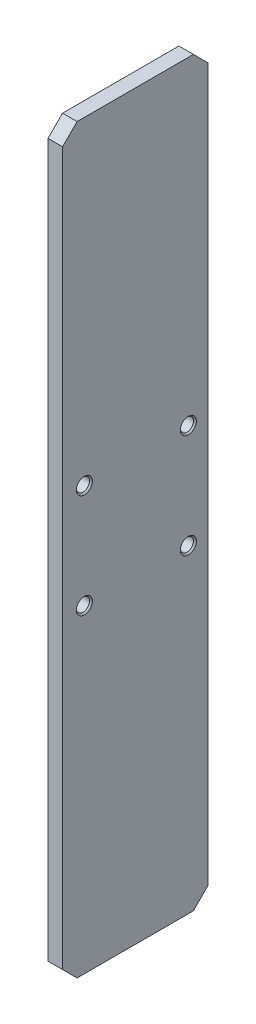
ISO-10303-21;
HEADER;
FILE_DESCRIPTION(('STEP AP214'),'2;1');
FILE_NAME('part.step','',(''),(''),'','','');
FILE_SCHEMA(('AUTOMOTIVE_DESIGN { 1 0 10303 214 1 1 1 1 }'));
ENDSEC;
DATA;
#1=APPLICATION_CONTEXT('core data for automotive mechanical design processes');
#2=APPLICATION_PROTOCOL_DEFINITION('international standard','automotive_design',2000,#1);
#3=PRODUCT_CONTEXT('',#1,'mechanical');
#4=PRODUCT('Part','Part','',(#3));
#5=PRODUCT_RELATED_PRODUCT_CATEGORY('part','',(#4));
#6=PRODUCT_DEFINITION_FORMATION('','',#4);
#7=PRODUCT_DEFINITION_CONTEXT('part definition',#1,'design');
#8=PRODUCT_DEFINITION('design','',#6,#7);
#9=PRODUCT_DEFINITION_SHAPE('','',#8);
#10=(LENGTH_UNIT() NAMED_UNIT(*) SI_UNIT(.MILLI.,.METRE.));
#11=(NAMED_UNIT(*) PLANE_ANGLE_UNIT() SI_UNIT($,.RADIAN.));
#12=(NAMED_UNIT(*) SI_UNIT($,.STERADIAN.) SOLID_ANGLE_UNIT());
#13=UNCERTAINTY_MEASURE_WITH_UNIT(LENGTH_MEASURE(1.E-05),#10,'distance_accuracy_value','');
#14=(GEOMETRIC_REPRESENTATION_CONTEXT(3) GLOBAL_UNCERTAINTY_ASSIGNED_CONTEXT((#13)) GLOBAL_UNIT_ASSIGNED_CONTEXT((#10,
#11,#12)) REPRESENTATION_CONTEXT('',''));
#15=CARTESIAN_POINT('',(0.,0.,0.));
#16=DIRECTION('',(0.,0.,1.));
#17=DIRECTION('',(1.,0.,0.));
#18=AXIS2_PLACEMENT_3D('',#15,#16,#17);
#19=CARTESIAN_POINT('',(1585.,510.,-100.));
#20=DIRECTION('',(0.,0.,1.));
#21=DIRECTION('',(-1.,0.,0.));
#22=AXIS2_PLACEMENT_3D('',#19,#20,#21);
#23=PLANE('',#22);
#24=DIRECTION('',(0.,-1.,0.));
#25=VECTOR('',#24,1.);
#26=CARTESIAN_POINT('',(1585.,510.,-100.));
#27=LINE('',#26,#25);
#28=CARTESIAN_POINT('',(1585.,490.,-100.));
#29=VERTEX_POINT('',#28);
#30=CARTESIAN_POINT('',(1585.,-490.,-100.));
#31=VERTEX_POINT('',#30);
#32=EDGE_CURVE('E277',#29,#31,#27,.T.);
#33=ORIENTED_EDGE('',*,*,#32,.T.);
#34=DIRECTION('',(-1.,0.,0.));
#35=VECTOR('',#34,1.);
#36=CARTESIAN_POINT('',(1585.,-490.,-100.));
#37=LINE('',#36,#35);
#38=CARTESIAN_POINT('',(1565.,-490.,-100.));
#39=VERTEX_POINT('',#38);
#40=EDGE_CURVE('E120',#31,#39,#37,.T.);
#41=ORIENTED_EDGE('',*,*,#40,.T.);
#42=DIRECTION('',(0.,-1.,0.));
#43=VECTOR('',#42,1.);
#44=CARTESIAN_POINT('',(1565.,510.,-100.));
#45=LINE('',#44,#43);
#46=CARTESIAN_POINT('',(1565.,490.,-100.));
#47=VERTEX_POINT('',#46);
#48=EDGE_CURVE('E104',#47,#39,#45,.T.);
#49=ORIENTED_EDGE('',*,*,#48,.F.);
#50=DIRECTION('',(1.,0.,0.));
#51=VECTOR('',#50,1.);
#52=CARTESIAN_POINT('',(1585.,490.,-100.));
#53=LINE('',#52,#51);
#54=EDGE_CURVE('E117',#47,#29,#53,.T.);
#55=ORIENTED_EDGE('',*,*,#54,.T.);
#56=EDGE_LOOP('',(#33,#41,#49,#55));
#57=FACE_BOUND('',#56,.T.);
#58=ADVANCED_FACE('F34',(#57),#23,.F.);
#59=CARTESIAN_POINT('',(1585.,-510.,-100.));
#60=DIRECTION('',(0.,1.,0.));
#61=DIRECTION('',(0.,0.,1.));
#62=AXIS2_PLACEMENT_3D('',#59,#60,#61);
#63=PLANE('',#62);
#64=DIRECTION('',(0.,0.,1.));
#65=VECTOR('',#64,1.);
#66=CARTESIAN_POINT('',(1565.,-510.,-100.));
#67=LINE('',#66,#65);
#68=CARTESIAN_POINT('',(1565.,-510.,-79.9999999999998));
#69=VERTEX_POINT('',#68);
#70=CARTESIAN_POINT('',(1565.,-510.,80.0000000000001));
#71=VERTEX_POINT('',#70);
#72=EDGE_CURVE('E121',#69,#71,#67,.T.);
#73=ORIENTED_EDGE('',*,*,#72,.F.);
#74=DIRECTION('',(1.,0.,0.));
#75=VECTOR('',#74,1.);
#76=CARTESIAN_POINT('',(1585.,-510.,-79.9999999999998));
#77=LINE('',#76,#75);
#78=CARTESIAN_POINT('',(1585.,-510.,-79.9999999999998));
#79=VERTEX_POINT('',#78);
#80=EDGE_CURVE('E142',#69,#79,#77,.T.);
#81=ORIENTED_EDGE('',*,*,#80,.T.);
#82=DIRECTION('',(0.,0.,1.));
#83=VECTOR('',#82,1.);
#84=CARTESIAN_POINT('',(1585.,-510.,-100.));
#85=LINE('',#84,#83);
#86=CARTESIAN_POINT('',(1585.,-510.,80.0000000000001));
#87=VERTEX_POINT('',#86);
#88=EDGE_CURVE('E273',#79,#87,#85,.T.);
#89=ORIENTED_EDGE('',*,*,#88,.T.);
#90=DIRECTION('',(-1.,0.,0.));
#91=VECTOR('',#90,1.);
#92=CARTESIAN_POINT('',(1585.,-510.,80.0000000000001));
#93=LINE('',#92,#91);
#94=EDGE_CURVE('E139',#87,#71,#93,.T.);
#95=ORIENTED_EDGE('',*,*,#94,.T.);
#96=EDGE_LOOP('',(#73,#81,#89,#95));
#97=FACE_BOUND('',#96,.T.);
#98=ADVANCED_FACE('F220',(#97),#63,.F.);
#99=CARTESIAN_POINT('',(1585.,510.,100.));
#100=DIRECTION('',(0.,0.,-1.));
#101=DIRECTION('',(1.,0.,0.));
#102=AXIS2_PLACEMENT_3D('',#99,#100,#101);
#103=PLANE('',#102);
#104=DIRECTION('',(0.,1.,0.));
#105=VECTOR('',#104,1.);
#106=CARTESIAN_POINT('',(1565.,510.,100.));
#107=LINE('',#106,#105);
#108=CARTESIAN_POINT('',(1565.,-490.,100.));
#109=VERTEX_POINT('',#108);
#110=CARTESIAN_POINT('',(1565.,490.,100.));
#111=VERTEX_POINT('',#110);
#112=EDGE_CURVE('E282',#109,#111,#107,.T.);
#113=ORIENTED_EDGE('',*,*,#112,.F.);
#114=DIRECTION('',(1.,0.,0.));
#115=VECTOR('',#114,1.);
#116=CARTESIAN_POINT('',(1585.,-490.,100.));
#117=LINE('',#116,#115);
#118=CARTESIAN_POINT('',(1585.,-490.,100.));
#119=VERTEX_POINT('',#118);
#120=EDGE_CURVE('E56',#109,#119,#117,.T.);
#121=ORIENTED_EDGE('',*,*,#120,.T.);
#122=DIRECTION('',(0.,1.,0.));
#123=VECTOR('',#122,1.);
#124=CARTESIAN_POINT('',(1585.,510.,100.));
#125=LINE('',#124,#123);
#126=CARTESIAN_POINT('',(1585.,490.,100.));
#127=VERTEX_POINT('',#126);
#128=EDGE_CURVE('E130',#119,#127,#125,.T.);
#129=ORIENTED_EDGE('',*,*,#128,.T.);
#130=DIRECTION('',(-1.,0.,0.));
#131=VECTOR('',#130,1.);
#132=CARTESIAN_POINT('',(1585.,490.,100.));
#133=LINE('',#132,#131);
#134=EDGE_CURVE('E150',#127,#111,#133,.T.);
#135=ORIENTED_EDGE('',*,*,#134,.T.);
#136=EDGE_LOOP('',(#113,#121,#129,#135));
#137=FACE_BOUND('',#136,.T.);
#138=ADVANCED_FACE('F225',(#137),#103,.F.);
#139=CARTESIAN_POINT('',(1585.,510.,-100.));
#140=DIRECTION('',(0.,-1.,0.));
#141=DIRECTION('',(0.,0.,-1.));
#142=AXIS2_PLACEMENT_3D('',#139,#140,#141);
#143=PLANE('',#142);
#144=DIRECTION('',(0.,0.,-1.));
#145=VECTOR('',#144,1.);
#146=CARTESIAN_POINT('',(1585.,510.,-100.));
#147=LINE('',#146,#145);
#148=CARTESIAN_POINT('',(1585.,510.,80.));
#149=VERTEX_POINT('',#148);
#150=CARTESIAN_POINT('',(1585.,510.,-80.0000000000001));
#151=VERTEX_POINT('',#150);
#152=EDGE_CURVE('E126',#149,#151,#147,.T.);
#153=ORIENTED_EDGE('',*,*,#152,.T.);
#154=DIRECTION('',(-1.,0.,0.));
#155=VECTOR('',#154,1.);
#156=CARTESIAN_POINT('',(1585.,510.,-80.0000000000001));
#157=LINE('',#156,#155);
#158=CARTESIAN_POINT('',(1565.,510.,-80.0000000000001));
#159=VERTEX_POINT('',#158);
#160=EDGE_CURVE('E156',#151,#159,#157,.T.);
#161=ORIENTED_EDGE('',*,*,#160,.T.);
#162=DIRECTION('',(0.,0.,-1.));
#163=VECTOR('',#162,1.);
#164=CARTESIAN_POINT('',(1565.,510.,-100.));
#165=LINE('',#164,#163);
#166=CARTESIAN_POINT('',(1565.,510.,80.));
#167=VERTEX_POINT('',#166);
#168=EDGE_CURVE('E106',#167,#159,#165,.T.);
#169=ORIENTED_EDGE('',*,*,#168,.F.);
#170=DIRECTION('',(1.,0.,0.));
#171=VECTOR('',#170,1.);
#172=CARTESIAN_POINT('',(1585.,510.,80.));
#173=LINE('',#172,#171);
#174=EDGE_CURVE('E154',#167,#149,#173,.T.);
#175=ORIENTED_EDGE('',*,*,#174,.T.);
#176=EDGE_LOOP('',(#153,#161,#169,#175));
#177=FACE_BOUND('',#176,.T.);
#178=ADVANCED_FACE('F268',(#177),#143,.F.);
#179=CARTESIAN_POINT('',(1585.,0.,0.));
#180=DIRECTION('',(1.,0.,0.));
#181=DIRECTION('',(0.,0.,1.));
#182=AXIS2_PLACEMENT_3D('',#179,#180,#181);
#183=PLANE('',#182);
#184=CARTESIAN_POINT('',(1585.,-71.4999999999999,-73.));
#185=DIRECTION('',(1.,0.,0.));
#186=DIRECTION('',(0.,0.,-1.));
#187=AXIS2_PLACEMENT_3D('',#184,#185,#186);
#188=CIRCLE('',#187,10.9999999999996);
#189=CARTESIAN_POINT('',(1585.,-71.4999999999999,-83.9999999999996));
#190=VERTEX_POINT('',#189);
#191=EDGE_CURVE('E167',#190,#190,#188,.F.);
#192=ORIENTED_EDGE('',*,*,#191,.T.);
#193=EDGE_LOOP('',(#192));
#194=FACE_BOUND('',#193,.T.);
#195=CARTESIAN_POINT('',(1585.,-71.4999999999999,70.));
#196=DIRECTION('',(1.,0.,0.));
#197=DIRECTION('',(0.,0.,-1.));
#198=AXIS2_PLACEMENT_3D('',#195,#196,#197);
#199=CIRCLE('',#198,10.9999999999996);
#200=CARTESIAN_POINT('',(1585.,-71.4999999999999,59.0000000000004));
#201=VERTEX_POINT('',#200);
#202=EDGE_CURVE('E164',#201,#201,#199,.F.);
#203=ORIENTED_EDGE('',*,*,#202,.T.);
#204=EDGE_LOOP('',(#203));
#205=FACE_BOUND('',#204,.T.);
#206=CARTESIAN_POINT('',(1585.,71.5000000000001,70.));
#207=DIRECTION('',(1.,0.,0.));
#208=DIRECTION('',(0.,0.,-1.));
#209=AXIS2_PLACEMENT_3D('',#206,#207,#208);
#210=CIRCLE('',#209,10.9999999999996);
#211=CARTESIAN_POINT('',(1585.,71.5000000000001,59.0000000000004));
#212=VERTEX_POINT('',#211);
#213=EDGE_CURVE('E161',#212,#212,#210,.F.);
#214=ORIENTED_EDGE('',*,*,#213,.T.);
#215=EDGE_LOOP('',(#214));
#216=FACE_BOUND('',#215,.T.);
#217=CARTESIAN_POINT('',(1585.,71.5000000000001,-73.));
#218=DIRECTION('',(1.,0.,0.));
#219=DIRECTION('',(0.,0.,-1.));
#220=AXIS2_PLACEMENT_3D('',#217,#218,#219);
#221=CIRCLE('',#220,10.9999999999996);
#222=CARTESIAN_POINT('',(1585.,71.5000000000001,-83.9999999999995));
#223=VERTEX_POINT('',#222);
#224=EDGE_CURVE('E158',#223,#223,#221,.F.);
#225=ORIENTED_EDGE('',*,*,#224,.T.);
#226=EDGE_LOOP('',(#225));
#227=FACE_BOUND('',#226,.T.);
#228=ORIENTED_EDGE('',*,*,#88,.F.);
#229=DIRECTION('',(0.,-0.707106781186544,0.707106781186551));
#230=VECTOR('',#229,1.);
#231=CARTESIAN_POINT('',(1585.,-295.000000000003,-294.999999999999));
#232=LINE('',#231,#230);
#233=EDGE_CURVE('E148',#79,#31,#232,.F.);
#234=ORIENTED_EDGE('',*,*,#233,.T.);
#235=ORIENTED_EDGE('',*,*,#32,.F.);
#236=DIRECTION('',(0.,-0.707106781186549,-0.707106781186546));
#237=VECTOR('',#236,1.);
#238=CARTESIAN_POINT('',(1585.,294.999999999999,-295.));
#239=LINE('',#238,#237);
#240=EDGE_CURVE('E125',#29,#151,#239,.F.);
#241=ORIENTED_EDGE('',*,*,#240,.T.);
#242=ORIENTED_EDGE('',*,*,#152,.F.);
#243=DIRECTION('',(0.,0.707106781186544,-0.707106781186551));
#244=VECTOR('',#243,1.);
#245=CARTESIAN_POINT('',(1585.,295.000000000003,295.));
#246=LINE('',#245,#244);
#247=EDGE_CURVE('E49',#149,#127,#246,.F.);
#248=ORIENTED_EDGE('',*,*,#247,.T.);
#249=ORIENTED_EDGE('',*,*,#128,.F.);
#250=DIRECTION('',(0.,0.707106781186549,0.707106781186546));
#251=VECTOR('',#250,1.);
#252=CARTESIAN_POINT('',(1585.,-294.999999999999,295.));
#253=LINE('',#252,#251);
#254=EDGE_CURVE('E146',#119,#87,#253,.F.);
#255=ORIENTED_EDGE('',*,*,#254,.T.);
#256=EDGE_LOOP('',(#228,#234,#235,#241,#242,#248,#249,#255));
#257=FACE_BOUND('',#256,.T.);
#258=ADVANCED_FACE('F266',(#194,#205,#216,#227,#257),#183,.T.);
#259=CARTESIAN_POINT('',(1565.,0.,0.));
#260=DIRECTION('',(1.,0.,0.));
#261=DIRECTION('',(0.,0.,1.));
#262=AXIS2_PLACEMENT_3D('',#259,#260,#261);
#263=PLANE('',#262);
#264=CARTESIAN_POINT('',(1565.,-71.4999999999999,-73.));
#265=DIRECTION('',(1.,0.,0.));
#266=DIRECTION('',(0.,0.,-1.));
#267=AXIS2_PLACEMENT_3D('',#264,#265,#266);
#268=CIRCLE('',#267,10.9999999999998);
#269=CARTESIAN_POINT('',(1565.,-71.4999999999999,-83.9999999999998));
#270=VERTEX_POINT('',#269);
#271=EDGE_CURVE('E11',#270,#270,#268,.T.);
#272=ORIENTED_EDGE('',*,*,#271,.T.);
#273=EDGE_LOOP('',(#272));
#274=FACE_BOUND('',#273,.T.);
#275=CARTESIAN_POINT('',(1565.,-71.4999999999999,70.));
#276=DIRECTION('',(1.,0.,0.));
#277=DIRECTION('',(0.,0.,-1.));
#278=AXIS2_PLACEMENT_3D('',#275,#276,#277);
#279=CIRCLE('',#278,10.9999999999998);
#280=CARTESIAN_POINT('',(1565.,-71.4999999999999,59.0000000000002));
#281=VERTEX_POINT('',#280);
#282=EDGE_CURVE('E42',#281,#281,#279,.T.);
#283=ORIENTED_EDGE('',*,*,#282,.T.);
#284=EDGE_LOOP('',(#283));
#285=FACE_BOUND('',#284,.T.);
#286=CARTESIAN_POINT('',(1565.,71.5000000000001,70.));
#287=DIRECTION('',(1.,0.,0.));
#288=DIRECTION('',(0.,0.,-1.));
#289=AXIS2_PLACEMENT_3D('',#286,#287,#288);
#290=CIRCLE('',#289,10.9999999999998);
#291=CARTESIAN_POINT('',(1565.,71.5000000000001,59.0000000000002));
#292=VERTEX_POINT('',#291);
#293=EDGE_CURVE('E197',#292,#292,#290,.T.);
#294=ORIENTED_EDGE('',*,*,#293,.T.);
#295=EDGE_LOOP('',(#294));
#296=FACE_BOUND('',#295,.T.);
#297=CARTESIAN_POINT('',(1565.,71.5000000000001,-73.));
#298=DIRECTION('',(1.,0.,0.));
#299=DIRECTION('',(0.,0.,-1.));
#300=AXIS2_PLACEMENT_3D('',#297,#298,#299);
#301=CIRCLE('',#300,10.9999999999998);
#302=CARTESIAN_POINT('',(1565.,71.5000000000001,-83.9999999999998));
#303=VERTEX_POINT('',#302);
#304=EDGE_CURVE('E194',#303,#303,#301,.T.);
#305=ORIENTED_EDGE('',*,*,#304,.T.);
#306=EDGE_LOOP('',(#305));
#307=FACE_BOUND('',#306,.T.);
#308=ORIENTED_EDGE('',*,*,#48,.T.);
#309=DIRECTION('',(0.,0.707106781186544,-0.707106781186551));
#310=VECTOR('',#309,1.);
#311=CARTESIAN_POINT('',(1565.,-490.,-100.));
#312=LINE('',#311,#310);
#313=EDGE_CURVE('E137',#39,#69,#312,.F.);
#314=ORIENTED_EDGE('',*,*,#313,.T.);
#315=ORIENTED_EDGE('',*,*,#72,.T.);
#316=DIRECTION('',(0.,-0.707106781186549,-0.707106781186546));
#317=VECTOR('',#316,1.);
#318=CARTESIAN_POINT('',(1565.,-510.,80.0000000000001));
#319=LINE('',#318,#317);
#320=EDGE_CURVE('E111',#71,#109,#319,.F.);
#321=ORIENTED_EDGE('',*,*,#320,.T.);
#322=ORIENTED_EDGE('',*,*,#112,.T.);
#323=DIRECTION('',(0.,-0.707106781186544,0.707106781186551));
#324=VECTOR('',#323,1.);
#325=CARTESIAN_POINT('',(1565.,490.,100.));
#326=LINE('',#325,#324);
#327=EDGE_CURVE('E112',#111,#167,#326,.F.);
#328=ORIENTED_EDGE('',*,*,#327,.T.);
#329=ORIENTED_EDGE('',*,*,#168,.T.);
#330=DIRECTION('',(0.,0.707106781186549,0.707106781186546));
#331=VECTOR('',#330,1.);
#332=CARTESIAN_POINT('',(1565.,510.,-80.0000000000001));
#333=LINE('',#332,#331);
#334=EDGE_CURVE('E101',#159,#47,#333,.F.);
#335=ORIENTED_EDGE('',*,*,#334,.T.);
#336=EDGE_LOOP('',(#308,#314,#315,#321,#322,#328,#329,#335));
#337=FACE_BOUND('',#336,.T.);
#338=ADVANCED_FACE('F103',(#274,#285,#296,#307,#337),#263,.F.);
#339=CARTESIAN_POINT('',(1585.,-490.,-100.));
#340=DIRECTION('',(0.,0.707106781186551,0.707106781186543));
#341=DIRECTION('',(-1.,0.,0.));
#342=AXIS2_PLACEMENT_3D('',#339,#340,#341);
#343=PLANE('',#342);
#344=ORIENTED_EDGE('',*,*,#233,.F.);
#345=ORIENTED_EDGE('',*,*,#80,.F.);
#346=ORIENTED_EDGE('',*,*,#313,.F.);
#347=ORIENTED_EDGE('',*,*,#40,.F.);
#348=EDGE_LOOP('',(#344,#345,#346,#347));
#349=FACE_BOUND('',#348,.T.);
#350=ADVANCED_FACE('F230',(#349),#343,.F.);
#351=CARTESIAN_POINT('',(1585.,-510.,80.0000000000001));
#352=DIRECTION('',(0.,0.707106781186546,-0.707106781186549));
#353=DIRECTION('',(-1.,0.,0.));
#354=AXIS2_PLACEMENT_3D('',#351,#352,#353);
#355=PLANE('',#354);
#356=ORIENTED_EDGE('',*,*,#254,.F.);
#357=ORIENTED_EDGE('',*,*,#120,.F.);
#358=ORIENTED_EDGE('',*,*,#320,.F.);
#359=ORIENTED_EDGE('',*,*,#94,.F.);
#360=EDGE_LOOP('',(#356,#357,#358,#359));
#361=FACE_BOUND('',#360,.T.);
#362=ADVANCED_FACE('F233',(#361),#355,.F.);
#363=CARTESIAN_POINT('',(1585.,510.,-80.0000000000001));
#364=DIRECTION('',(0.,-0.707106781186546,0.707106781186549));
#365=DIRECTION('',(-1.,0.,0.));
#366=AXIS2_PLACEMENT_3D('',#363,#364,#365);
#367=PLANE('',#366);
#368=ORIENTED_EDGE('',*,*,#240,.F.);
#369=ORIENTED_EDGE('',*,*,#54,.F.);
#370=ORIENTED_EDGE('',*,*,#334,.F.);
#371=ORIENTED_EDGE('',*,*,#160,.F.);
#372=EDGE_LOOP('',(#368,#369,#370,#371));
#373=FACE_BOUND('',#372,.T.);
#374=ADVANCED_FACE('F124',(#373),#367,.F.);
#375=CARTESIAN_POINT('',(1585.,490.,100.));
#376=DIRECTION('',(0.,-0.707106781186551,-0.707106781186544));
#377=DIRECTION('',(-1.,0.,0.));
#378=AXIS2_PLACEMENT_3D('',#375,#376,#377);
#379=PLANE('',#378);
#380=ORIENTED_EDGE('',*,*,#247,.F.);
#381=ORIENTED_EDGE('',*,*,#174,.F.);
#382=ORIENTED_EDGE('',*,*,#327,.F.);
#383=ORIENTED_EDGE('',*,*,#134,.F.);
#384=EDGE_LOOP('',(#380,#381,#382,#383));
#385=FACE_BOUND('',#384,.T.);
#386=ADVANCED_FACE('F240',(#385),#379,.F.);
#387=CARTESIAN_POINT('',(1585.,71.5000000000001,70.));
#388=DIRECTION('',(-1.,0.,0.));
#389=DIRECTION('',(0.,0.,1.));
#390=AXIS2_PLACEMENT_3D('',#387,#388,#389);
#391=CYLINDRICAL_SURFACE('',#390,9.00000000000001);
#392=CARTESIAN_POINT('',(1583.,71.5000000000001,70.));
#393=DIRECTION('',(1.,0.,0.));
#394=DIRECTION('',(0.,0.,-1.));
#395=AXIS2_PLACEMENT_3D('',#392,#393,#394);
#396=CIRCLE('',#395,9.00000000000001);
#397=CARTESIAN_POINT('',(1583.,71.5000000000001,79.));
#398=VERTEX_POINT('',#397);
#399=EDGE_CURVE('E185',#398,#398,#396,.T.);
#400=CARTESIAN_POINT('',(1567.,71.5000000000001,70.));
#401=DIRECTION('',(1.,0.,0.));
#402=DIRECTION('',(0.,0.,-1.));
#403=AXIS2_PLACEMENT_3D('',#400,#401,#402);
#404=CIRCLE('',#403,9.00000000000001);
#405=CARTESIAN_POINT('',(1567.,71.5000000000001,79.));
#406=VERTEX_POINT('',#405);
#407=EDGE_CURVE('E182',#406,#406,#404,.F.);
#408=CARTESIAN_POINT('',(1583.,71.5000000000001,79.));
#409=CARTESIAN_POINT('',(1582.83333333333,71.5000000000001,79.));
#410=CARTESIAN_POINT('',(1582.66666666667,71.5000000000001,79.));
#411=CARTESIAN_POINT('',(1582.33333333333,71.5000000000001,79.));
#412=CARTESIAN_POINT('',(1582.16666666667,71.5000000000001,79.));
#413=CARTESIAN_POINT('',(1581.83333333333,71.5000000000001,79.));
#414=CARTESIAN_POINT('',(1581.66666666667,71.5000000000001,79.));
#415=CARTESIAN_POINT('',(1581.33333333333,71.5000000000001,79.));
#416=CARTESIAN_POINT('',(1581.16666666667,71.5000000000001,79.));
#417=CARTESIAN_POINT('',(1580.83333333333,71.5000000000001,79.));
#418=CARTESIAN_POINT('',(1580.66666666667,71.5000000000001,79.));
#419=CARTESIAN_POINT('',(1580.33333333333,71.5000000000001,79.));
#420=CARTESIAN_POINT('',(1580.16666666667,71.5000000000001,79.));
#421=CARTESIAN_POINT('',(1579.83333333333,71.5000000000001,79.));
#422=CARTESIAN_POINT('',(1579.66666666667,71.5000000000001,79.));
#423=CARTESIAN_POINT('',(1579.33333333333,71.5000000000001,79.));
#424=CARTESIAN_POINT('',(1579.16666666667,71.5000000000001,79.));
#425=CARTESIAN_POINT('',(1578.83333333333,71.5000000000001,79.));
#426=CARTESIAN_POINT('',(1578.66666666667,71.5000000000001,79.));
#427=CARTESIAN_POINT('',(1578.33333333333,71.5000000000001,79.));
#428=CARTESIAN_POINT('',(1578.16666666667,71.5000000000001,79.));
#429=CARTESIAN_POINT('',(1577.83333333333,71.5000000000001,79.));
#430=CARTESIAN_POINT('',(1577.66666666667,71.5000000000001,79.));
#431=CARTESIAN_POINT('',(1577.33333333333,71.5000000000001,79.));
#432=CARTESIAN_POINT('',(1577.16666666667,71.5000000000001,79.));
#433=CARTESIAN_POINT('',(1576.83333333333,71.5000000000001,79.));
#434=CARTESIAN_POINT('',(1576.66666666667,71.5000000000001,79.));
#435=CARTESIAN_POINT('',(1576.33333333333,71.5000000000001,79.));
#436=CARTESIAN_POINT('',(1576.16666666667,71.5000000000001,79.));
#437=CARTESIAN_POINT('',(1575.83333333333,71.5000000000001,79.));
#438=CARTESIAN_POINT('',(1575.66666666667,71.5000000000001,79.));
#439=CARTESIAN_POINT('',(1575.33333333333,71.5000000000001,79.));
#440=CARTESIAN_POINT('',(1575.16666666667,71.5000000000001,79.));
#441=CARTESIAN_POINT('',(1574.83333333333,71.5000000000001,79.));
#442=CARTESIAN_POINT('',(1574.66666666667,71.5000000000001,79.));
#443=CARTESIAN_POINT('',(1574.33333333333,71.5000000000001,79.));
#444=CARTESIAN_POINT('',(1574.16666666667,71.5000000000001,79.));
#445=CARTESIAN_POINT('',(1573.83333333333,71.5000000000001,79.));
#446=CARTESIAN_POINT('',(1573.66666666667,71.5000000000001,79.));
#447=CARTESIAN_POINT('',(1573.33333333333,71.5000000000001,79.));
#448=CARTESIAN_POINT('',(1573.16666666667,71.5000000000001,79.));
#449=CARTESIAN_POINT('',(1572.83333333333,71.5000000000001,79.));
#450=CARTESIAN_POINT('',(1572.66666666667,71.5000000000001,79.));
#451=CARTESIAN_POINT('',(1572.33333333333,71.5000000000001,79.));
#452=CARTESIAN_POINT('',(1572.16666666667,71.5000000000001,79.));
#453=CARTESIAN_POINT('',(1571.83333333333,71.5000000000001,79.));
#454=CARTESIAN_POINT('',(1571.66666666667,71.5000000000001,79.));
#455=CARTESIAN_POINT('',(1571.33333333333,71.5000000000001,79.));
#456=CARTESIAN_POINT('',(1571.16666666667,71.5000000000001,79.));
#457=CARTESIAN_POINT('',(1570.83333333333,71.5000000000001,79.));
#458=CARTESIAN_POINT('',(1570.66666666667,71.5000000000001,79.));
#459=CARTESIAN_POINT('',(1570.33333333333,71.5000000000001,79.));
#460=CARTESIAN_POINT('',(1570.16666666667,71.5000000000001,79.));
#461=CARTESIAN_POINT('',(1569.83333333333,71.5000000000001,79.));
#462=CARTESIAN_POINT('',(1569.66666666667,71.5000000000001,79.));
#463=CARTESIAN_POINT('',(1569.33333333333,71.5000000000001,79.));
#464=CARTESIAN_POINT('',(1569.16666666667,71.5000000000001,79.));
#465=CARTESIAN_POINT('',(1568.83333333333,71.5000000000001,79.));
#466=CARTESIAN_POINT('',(1568.66666666667,71.5000000000001,79.));
#467=CARTESIAN_POINT('',(1568.33333333333,71.5000000000001,79.));
#468=CARTESIAN_POINT('',(1568.16666666667,71.5000000000001,79.));
#469=CARTESIAN_POINT('',(1567.83333333333,71.5000000000001,79.));
#470=CARTESIAN_POINT('',(1567.66666666667,71.5000000000001,79.));
#471=CARTESIAN_POINT('',(1567.33333333333,71.5000000000001,79.));
#472=CARTESIAN_POINT('',(1567.16666666667,71.5000000000001,79.));
#473=CARTESIAN_POINT('',(1567.,71.5000000000001,79.));
#474=B_SPLINE_CURVE_WITH_KNOTS('',3,(#408,#409,#410,#411,#412,#413,#414,#415,#416,#417,#418,
#419,#420,#421,#422,#423,#424,#425,#426,#427,#428,#429,#430,#431,#432,#433,#434,#435,#436,#437,
#438,#439,#440,#441,#442,#443,#444,#445,#446,#447,#448,#449,#450,#451,#452,#453,#454,#455,#456,
#457,#458,#459,#460,#461,#462,#463,#464,#465,#466,#467,#468,#469,#470,#471,#472,#473),
.UNSPECIFIED.,.F.,.F.,(4,2,2,2,2,2,2,2,2,2,2,2,2,2,2,2,2,2,2,2,2,2,2,2,2,2,2,2,2,2,2,2,4),(0.,
0.500000000000167,1.00000000000011,1.50000000000006,2.00000000000022,2.50000000000017,
3.00000000000011,3.50000000000028,4.00000000000023,4.50000000000017,5.00000000000034,
5.50000000000028,6.00000000000023,6.50000000000039,7.00000000000034,7.50000000000028,
8.00000000000023,8.5000000000004,9.00000000000034,9.50000000000029,10.0000000000005,
10.5000000000004,11.0000000000003,11.5000000000005,12.0000000000005,12.5000000000004,
13.0000000000006,13.5000000000005,14.0000000000005,14.5000000000006,15.0000000000006,
15.5000000000005,16.0000000000005),.UNSPECIFIED.);
#475=EDGE_CURVE('BSEAM243',#398,#406,#474,.T.);
#476=ORIENTED_EDGE('',*,*,#399,.T.);
#477=ORIENTED_EDGE('',*,*,#407,.T.);
#478=ORIENTED_EDGE('',*,*,#475,.T.);
#479=ORIENTED_EDGE('',*,*,#475,.F.);
#480=EDGE_LOOP('',(#476,#478,#477,#479));
#481=FACE_BOUND('',#480,.T.);
#482=ADVANCED_FACE('F243',(#481),#391,.F.);
#483=CARTESIAN_POINT('',(1585.,71.5000000000001,-73.));
#484=DIRECTION('',(-1.,0.,0.));
#485=DIRECTION('',(0.,0.,1.));
#486=AXIS2_PLACEMENT_3D('',#483,#484,#485);
#487=CYLINDRICAL_SURFACE('',#486,9.00000000000001);
#488=CARTESIAN_POINT('',(1583.,71.5000000000001,-73.));
#489=DIRECTION('',(1.,0.,0.));
#490=DIRECTION('',(0.,0.,-1.));
#491=AXIS2_PLACEMENT_3D('',#488,#489,#490);
#492=CIRCLE('',#491,9.00000000000001);
#493=CARTESIAN_POINT('',(1583.,71.5000000000001,-64.));
#494=VERTEX_POINT('',#493);
#495=EDGE_CURVE('E191',#494,#494,#492,.T.);
#496=CARTESIAN_POINT('',(1567.,71.5000000000001,-73.));
#497=DIRECTION('',(1.,0.,0.));
#498=DIRECTION('',(0.,0.,-1.));
#499=AXIS2_PLACEMENT_3D('',#496,#497,#498);
#500=CIRCLE('',#499,9.00000000000001);
#501=CARTESIAN_POINT('',(1567.,71.5000000000001,-64.));
#502=VERTEX_POINT('',#501);
#503=EDGE_CURVE('E188',#502,#502,#500,.F.);
#504=CARTESIAN_POINT('',(1583.,71.5000000000001,-64.));
#505=CARTESIAN_POINT('',(1582.83333333333,71.5000000000001,-64.));
#506=CARTESIAN_POINT('',(1582.66666666667,71.5000000000001,-64.));
#507=CARTESIAN_POINT('',(1582.33333333333,71.5000000000001,-64.));
#508=CARTESIAN_POINT('',(1582.16666666667,71.5000000000001,-64.));
#509=CARTESIAN_POINT('',(1581.83333333333,71.5000000000001,-64.));
#510=CARTESIAN_POINT('',(1581.66666666667,71.5000000000001,-64.));
#511=CARTESIAN_POINT('',(1581.33333333333,71.5000000000001,-64.));
#512=CARTESIAN_POINT('',(1581.16666666667,71.5000000000001,-64.));
#513=CARTESIAN_POINT('',(1580.83333333333,71.5000000000001,-64.));
#514=CARTESIAN_POINT('',(1580.66666666667,71.5000000000001,-64.));
#515=CARTESIAN_POINT('',(1580.33333333333,71.5000000000001,-64.));
#516=CARTESIAN_POINT('',(1580.16666666667,71.5000000000001,-64.));
#517=CARTESIAN_POINT('',(1579.83333333333,71.5000000000001,-64.));
#518=CARTESIAN_POINT('',(1579.66666666667,71.5000000000001,-64.));
#519=CARTESIAN_POINT('',(1579.33333333333,71.5000000000001,-64.));
#520=CARTESIAN_POINT('',(1579.16666666667,71.5000000000001,-64.));
#521=CARTESIAN_POINT('',(1578.83333333333,71.5000000000001,-64.));
#522=CARTESIAN_POINT('',(1578.66666666667,71.5000000000001,-64.));
#523=CARTESIAN_POINT('',(1578.33333333333,71.5000000000001,-64.));
#524=CARTESIAN_POINT('',(1578.16666666667,71.5000000000001,-64.));
#525=CARTESIAN_POINT('',(1577.83333333333,71.5000000000001,-64.));
#526=CARTESIAN_POINT('',(1577.66666666667,71.5000000000001,-64.));
#527=CARTESIAN_POINT('',(1577.33333333333,71.5000000000001,-64.));
#528=CARTESIAN_POINT('',(1577.16666666667,71.5000000000001,-64.));
#529=CARTESIAN_POINT('',(1576.83333333333,71.5000000000001,-64.));
#530=CARTESIAN_POINT('',(1576.66666666667,71.5000000000001,-64.));
#531=CARTESIAN_POINT('',(1576.33333333333,71.5000000000001,-64.));
#532=CARTESIAN_POINT('',(1576.16666666667,71.5000000000001,-64.));
#533=CARTESIAN_POINT('',(1575.83333333333,71.5000000000001,-64.));
#534=CARTESIAN_POINT('',(1575.66666666667,71.5000000000001,-64.));
#535=CARTESIAN_POINT('',(1575.33333333333,71.5000000000001,-64.));
#536=CARTESIAN_POINT('',(1575.16666666667,71.5000000000001,-64.));
#537=CARTESIAN_POINT('',(1574.83333333333,71.5000000000001,-64.));
#538=CARTESIAN_POINT('',(1574.66666666667,71.5000000000001,-64.));
#539=CARTESIAN_POINT('',(1574.33333333333,71.5000000000001,-64.));
#540=CARTESIAN_POINT('',(1574.16666666667,71.5000000000001,-64.));
#541=CARTESIAN_POINT('',(1573.83333333333,71.5000000000001,-64.));
#542=CARTESIAN_POINT('',(1573.66666666667,71.5000000000001,-64.));
#543=CARTESIAN_POINT('',(1573.33333333333,71.5000000000001,-64.));
#544=CARTESIAN_POINT('',(1573.16666666667,71.5000000000001,-64.));
#545=CARTESIAN_POINT('',(1572.83333333333,71.5000000000001,-64.));
#546=CARTESIAN_POINT('',(1572.66666666667,71.5000000000001,-64.));
#547=CARTESIAN_POINT('',(1572.33333333333,71.5000000000001,-64.));
#548=CARTESIAN_POINT('',(1572.16666666667,71.5000000000001,-64.));
#549=CARTESIAN_POINT('',(1571.83333333333,71.5000000000001,-64.));
#550=CARTESIAN_POINT('',(1571.66666666667,71.5000000000001,-64.));
#551=CARTESIAN_POINT('',(1571.33333333333,71.5000000000001,-64.));
#552=CARTESIAN_POINT('',(1571.16666666667,71.5000000000001,-64.));
#553=CARTESIAN_POINT('',(1570.83333333333,71.5000000000001,-64.));
#554=CARTESIAN_POINT('',(1570.66666666667,71.5000000000001,-64.));
#555=CARTESIAN_POINT('',(1570.33333333333,71.5000000000001,-64.));
#556=CARTESIAN_POINT('',(1570.16666666667,71.5000000000001,-64.));
#557=CARTESIAN_POINT('',(1569.83333333333,71.5000000000001,-64.));
#558=CARTESIAN_POINT('',(1569.66666666667,71.5000000000001,-64.));
#559=CARTESIAN_POINT('',(1569.33333333333,71.5000000000001,-64.));
#560=CARTESIAN_POINT('',(1569.16666666667,71.5000000000001,-64.));
#561=CARTESIAN_POINT('',(1568.83333333333,71.5000000000001,-64.));
#562=CARTESIAN_POINT('',(1568.66666666667,71.5000000000001,-64.));
#563=CARTESIAN_POINT('',(1568.33333333333,71.5000000000001,-64.));
#564=CARTESIAN_POINT('',(1568.16666666667,71.5000000000001,-64.));
#565=CARTESIAN_POINT('',(1567.83333333333,71.5000000000001,-64.));
#566=CARTESIAN_POINT('',(1567.66666666667,71.5000000000001,-64.));
#567=CARTESIAN_POINT('',(1567.33333333333,71.5000000000001,-64.));
#568=CARTESIAN_POINT('',(1567.16666666667,71.5000000000001,-64.));
#569=CARTESIAN_POINT('',(1567.,71.5000000000001,-64.));
#570=B_SPLINE_CURVE_WITH_KNOTS('',3,(#504,#505,#506,#507,#508,#509,#510,#511,#512,#513,#514,
#515,#516,#517,#518,#519,#520,#521,#522,#523,#524,#525,#526,#527,#528,#529,#530,#531,#532,#533,
#534,#535,#536,#537,#538,#539,#540,#541,#542,#543,#544,#545,#546,#547,#548,#549,#550,#551,#552,
#553,#554,#555,#556,#557,#558,#559,#560,#561,#562,#563,#564,#565,#566,#567,#568,#569),
.UNSPECIFIED.,.F.,.F.,(4,2,2,2,2,2,2,2,2,2,2,2,2,2,2,2,2,2,2,2,2,2,2,2,2,2,2,2,2,2,2,2,4),(0.,
0.500000000000167,1.00000000000011,1.50000000000006,2.00000000000022,2.50000000000017,
3.00000000000011,3.50000000000028,4.00000000000023,4.50000000000017,5.00000000000034,
5.50000000000028,6.00000000000023,6.50000000000039,7.00000000000034,7.50000000000028,
8.00000000000023,8.5000000000004,9.00000000000034,9.50000000000029,10.0000000000005,
10.5000000000004,11.0000000000003,11.5000000000005,12.0000000000005,12.5000000000004,
13.0000000000006,13.5000000000005,14.0000000000005,14.5000000000006,15.0000000000006,
15.5000000000005,16.0000000000005),.UNSPECIFIED.);
#571=EDGE_CURVE('BSEAM301',#494,#502,#570,.T.);
#572=ORIENTED_EDGE('',*,*,#495,.T.);
#573=ORIENTED_EDGE('',*,*,#503,.T.);
#574=ORIENTED_EDGE('',*,*,#571,.T.);
#575=ORIENTED_EDGE('',*,*,#571,.F.);
#576=EDGE_LOOP('',(#572,#574,#573,#575));
#577=FACE_BOUND('',#576,.T.);
#578=ADVANCED_FACE('F301',(#577),#487,.F.);
#579=CARTESIAN_POINT('',(1585.,-71.4999999999999,-73.));
#580=DIRECTION('',(-1.,0.,0.));
#581=DIRECTION('',(0.,0.,1.));
#582=AXIS2_PLACEMENT_3D('',#579,#580,#581);
#583=CYLINDRICAL_SURFACE('',#582,9.00000000000001);
#584=CARTESIAN_POINT('',(1583.,-71.4999999999999,-73.));
#585=DIRECTION('',(1.,0.,0.));
#586=DIRECTION('',(0.,0.,-1.));
#587=AXIS2_PLACEMENT_3D('',#584,#585,#586);
#588=CIRCLE('',#587,9.00000000000001);
#589=CARTESIAN_POINT('',(1583.,-71.4999999999999,-64.));
#590=VERTEX_POINT('',#589);
#591=EDGE_CURVE('E173',#590,#590,#588,.T.);
#592=CARTESIAN_POINT('',(1567.,-71.4999999999999,-73.));
#593=DIRECTION('',(1.,0.,0.));
#594=DIRECTION('',(0.,0.,-1.));
#595=AXIS2_PLACEMENT_3D('',#592,#593,#594);
#596=CIRCLE('',#595,9.00000000000001);
#597=CARTESIAN_POINT('',(1567.,-71.4999999999999,-64.));
#598=VERTEX_POINT('',#597);
#599=EDGE_CURVE('E170',#598,#598,#596,.F.);
#600=CARTESIAN_POINT('',(1583.,-71.4999999999999,-64.));
#601=CARTESIAN_POINT('',(1582.83333333333,-71.4999999999999,-64.));
#602=CARTESIAN_POINT('',(1582.66666666667,-71.4999999999999,-64.));
#603=CARTESIAN_POINT('',(1582.33333333333,-71.4999999999999,-64.));
#604=CARTESIAN_POINT('',(1582.16666666667,-71.4999999999999,-64.));
#605=CARTESIAN_POINT('',(1581.83333333333,-71.4999999999999,-64.));
#606=CARTESIAN_POINT('',(1581.66666666667,-71.4999999999999,-64.));
#607=CARTESIAN_POINT('',(1581.33333333333,-71.4999999999999,-64.));
#608=CARTESIAN_POINT('',(1581.16666666667,-71.4999999999999,-64.));
#609=CARTESIAN_POINT('',(1580.83333333333,-71.4999999999999,-64.));
#610=CARTESIAN_POINT('',(1580.66666666667,-71.4999999999999,-64.));
#611=CARTESIAN_POINT('',(1580.33333333333,-71.4999999999999,-64.));
#612=CARTESIAN_POINT('',(1580.16666666667,-71.4999999999999,-64.));
#613=CARTESIAN_POINT('',(1579.83333333333,-71.4999999999999,-64.));
#614=CARTESIAN_POINT('',(1579.66666666667,-71.4999999999999,-64.));
#615=CARTESIAN_POINT('',(1579.33333333333,-71.4999999999999,-64.));
#616=CARTESIAN_POINT('',(1579.16666666667,-71.4999999999999,-64.));
#617=CARTESIAN_POINT('',(1578.83333333333,-71.4999999999999,-64.));
#618=CARTESIAN_POINT('',(1578.66666666667,-71.4999999999999,-64.));
#619=CARTESIAN_POINT('',(1578.33333333333,-71.4999999999999,-64.));
#620=CARTESIAN_POINT('',(1578.16666666667,-71.4999999999999,-64.));
#621=CARTESIAN_POINT('',(1577.83333333333,-71.4999999999999,-64.));
#622=CARTESIAN_POINT('',(1577.66666666667,-71.4999999999999,-64.));
#623=CARTESIAN_POINT('',(1577.33333333333,-71.4999999999999,-64.));
#624=CARTESIAN_POINT('',(1577.16666666667,-71.4999999999999,-64.));
#625=CARTESIAN_POINT('',(1576.83333333333,-71.4999999999999,-64.));
#626=CARTESIAN_POINT('',(1576.66666666667,-71.4999999999999,-64.));
#627=CARTESIAN_POINT('',(1576.33333333333,-71.4999999999999,-64.));
#628=CARTESIAN_POINT('',(1576.16666666667,-71.4999999999999,-64.));
#629=CARTESIAN_POINT('',(1575.83333333333,-71.4999999999999,-64.));
#630=CARTESIAN_POINT('',(1575.66666666667,-71.4999999999999,-64.));
#631=CARTESIAN_POINT('',(1575.33333333333,-71.4999999999999,-64.));
#632=CARTESIAN_POINT('',(1575.16666666667,-71.4999999999999,-64.));
#633=CARTESIAN_POINT('',(1574.83333333333,-71.4999999999999,-64.));
#634=CARTESIAN_POINT('',(1574.66666666667,-71.4999999999999,-64.));
#635=CARTESIAN_POINT('',(1574.33333333333,-71.4999999999999,-64.));
#636=CARTESIAN_POINT('',(1574.16666666667,-71.4999999999999,-64.));
#637=CARTESIAN_POINT('',(1573.83333333333,-71.4999999999999,-64.));
#638=CARTESIAN_POINT('',(1573.66666666667,-71.4999999999999,-64.));
#639=CARTESIAN_POINT('',(1573.33333333333,-71.4999999999999,-64.));
#640=CARTESIAN_POINT('',(1573.16666666667,-71.4999999999999,-64.));
#641=CARTESIAN_POINT('',(1572.83333333333,-71.4999999999999,-64.));
#642=CARTESIAN_POINT('',(1572.66666666667,-71.4999999999999,-64.));
#643=CARTESIAN_POINT('',(1572.33333333333,-71.4999999999999,-64.));
#644=CARTESIAN_POINT('',(1572.16666666667,-71.4999999999999,-64.));
#645=CARTESIAN_POINT('',(1571.83333333333,-71.4999999999999,-64.));
#646=CARTESIAN_POINT('',(1571.66666666667,-71.4999999999999,-64.));
#647=CARTESIAN_POINT('',(1571.33333333333,-71.4999999999999,-64.));
#648=CARTESIAN_POINT('',(1571.16666666667,-71.4999999999999,-64.));
#649=CARTESIAN_POINT('',(1570.83333333333,-71.4999999999999,-64.));
#650=CARTESIAN_POINT('',(1570.66666666667,-71.4999999999999,-64.));
#651=CARTESIAN_POINT('',(1570.33333333333,-71.4999999999999,-64.));
#652=CARTESIAN_POINT('',(1570.16666666667,-71.4999999999999,-64.));
#653=CARTESIAN_POINT('',(1569.83333333333,-71.4999999999999,-64.));
#654=CARTESIAN_POINT('',(1569.66666666667,-71.4999999999999,-64.));
#655=CARTESIAN_POINT('',(1569.33333333333,-71.4999999999999,-64.));
#656=CARTESIAN_POINT('',(1569.16666666667,-71.4999999999999,-64.));
#657=CARTESIAN_POINT('',(1568.83333333333,-71.4999999999999,-64.));
#658=CARTESIAN_POINT('',(1568.66666666667,-71.4999999999999,-64.));
#659=CARTESIAN_POINT('',(1568.33333333333,-71.4999999999999,-64.));
#660=CARTESIAN_POINT('',(1568.16666666667,-71.4999999999999,-64.));
#661=CARTESIAN_POINT('',(1567.83333333333,-71.4999999999999,-64.));
#662=CARTESIAN_POINT('',(1567.66666666667,-71.4999999999999,-64.));
#663=CARTESIAN_POINT('',(1567.33333333333,-71.4999999999999,-64.));
#664=CARTESIAN_POINT('',(1567.16666666667,-71.4999999999999,-64.));
#665=CARTESIAN_POINT('',(1567.,-71.4999999999999,-64.));
#666=B_SPLINE_CURVE_WITH_KNOTS('',3,(#600,#601,#602,#603,#604,#605,#606,#607,#608,#609,#610,
#611,#612,#613,#614,#615,#616,#617,#618,#619,#620,#621,#622,#623,#624,#625,#626,#627,#628,#629,
#630,#631,#632,#633,#634,#635,#636,#637,#638,#639,#640,#641,#642,#643,#644,#645,#646,#647,#648,
#649,#650,#651,#652,#653,#654,#655,#656,#657,#658,#659,#660,#661,#662,#663,#664,#665),
.UNSPECIFIED.,.F.,.F.,(4,2,2,2,2,2,2,2,2,2,2,2,2,2,2,2,2,2,2,2,2,2,2,2,2,2,2,2,2,2,2,2,4),(0.,
0.500000000000167,1.00000000000011,1.50000000000006,2.00000000000022,2.50000000000017,
3.00000000000011,3.50000000000028,4.00000000000023,4.50000000000017,5.00000000000034,
5.50000000000028,6.00000000000023,6.50000000000039,7.00000000000034,7.50000000000028,
8.00000000000023,8.5000000000004,9.00000000000034,9.50000000000029,10.0000000000005,
10.5000000000004,11.0000000000003,11.5000000000005,12.0000000000005,12.5000000000004,
13.0000000000006,13.5000000000005,14.0000000000005,14.5000000000006,15.0000000000006,
15.5000000000005,16.0000000000005),.UNSPECIFIED.);
#667=EDGE_CURVE('BSEAM305',#590,#598,#666,.T.);
#668=ORIENTED_EDGE('',*,*,#591,.T.);
#669=ORIENTED_EDGE('',*,*,#599,.T.);
#670=ORIENTED_EDGE('',*,*,#667,.T.);
#671=ORIENTED_EDGE('',*,*,#667,.F.);
#672=EDGE_LOOP('',(#668,#670,#669,#671));
#673=FACE_BOUND('',#672,.T.);
#674=ADVANCED_FACE('F305',(#673),#583,.F.);
#675=CARTESIAN_POINT('',(1585.,-71.4999999999999,70.));
#676=DIRECTION('',(-1.,0.,0.));
#677=DIRECTION('',(0.,0.,1.));
#678=AXIS2_PLACEMENT_3D('',#675,#676,#677);
#679=CYLINDRICAL_SURFACE('',#678,9.00000000000001);
#680=CARTESIAN_POINT('',(1583.,-71.4999999999999,70.));
#681=DIRECTION('',(1.,0.,0.));
#682=DIRECTION('',(0.,0.,-1.));
#683=AXIS2_PLACEMENT_3D('',#680,#681,#682);
#684=CIRCLE('',#683,9.00000000000001);
#685=CARTESIAN_POINT('',(1583.,-71.4999999999999,79.));
#686=VERTEX_POINT('',#685);
#687=EDGE_CURVE('E179',#686,#686,#684,.T.);
#688=CARTESIAN_POINT('',(1567.,-71.4999999999999,70.));
#689=DIRECTION('',(1.,0.,0.));
#690=DIRECTION('',(0.,0.,-1.));
#691=AXIS2_PLACEMENT_3D('',#688,#689,#690);
#692=CIRCLE('',#691,9.00000000000001);
#693=CARTESIAN_POINT('',(1567.,-71.4999999999999,79.));
#694=VERTEX_POINT('',#693);
#695=EDGE_CURVE('E176',#694,#694,#692,.F.);
#696=CARTESIAN_POINT('',(1583.,-71.4999999999999,79.));
#697=CARTESIAN_POINT('',(1582.83333333333,-71.4999999999999,79.));
#698=CARTESIAN_POINT('',(1582.66666666667,-71.4999999999999,79.));
#699=CARTESIAN_POINT('',(1582.33333333333,-71.4999999999999,79.));
#700=CARTESIAN_POINT('',(1582.16666666667,-71.4999999999999,79.));
#701=CARTESIAN_POINT('',(1581.83333333333,-71.4999999999999,79.));
#702=CARTESIAN_POINT('',(1581.66666666667,-71.4999999999999,79.));
#703=CARTESIAN_POINT('',(1581.33333333333,-71.4999999999999,79.));
#704=CARTESIAN_POINT('',(1581.16666666667,-71.4999999999999,79.));
#705=CARTESIAN_POINT('',(1580.83333333333,-71.4999999999999,79.));
#706=CARTESIAN_POINT('',(1580.66666666667,-71.4999999999999,79.));
#707=CARTESIAN_POINT('',(1580.33333333333,-71.4999999999999,79.));
#708=CARTESIAN_POINT('',(1580.16666666667,-71.4999999999999,79.));
#709=CARTESIAN_POINT('',(1579.83333333333,-71.4999999999999,79.));
#710=CARTESIAN_POINT('',(1579.66666666667,-71.4999999999999,79.));
#711=CARTESIAN_POINT('',(1579.33333333333,-71.4999999999999,79.));
#712=CARTESIAN_POINT('',(1579.16666666667,-71.4999999999999,79.));
#713=CARTESIAN_POINT('',(1578.83333333333,-71.4999999999999,79.));
#714=CARTESIAN_POINT('',(1578.66666666667,-71.4999999999999,79.));
#715=CARTESIAN_POINT('',(1578.33333333333,-71.4999999999999,79.));
#716=CARTESIAN_POINT('',(1578.16666666667,-71.4999999999999,79.));
#717=CARTESIAN_POINT('',(1577.83333333333,-71.4999999999999,79.));
#718=CARTESIAN_POINT('',(1577.66666666667,-71.4999999999999,79.));
#719=CARTESIAN_POINT('',(1577.33333333333,-71.4999999999999,79.));
#720=CARTESIAN_POINT('',(1577.16666666667,-71.4999999999999,79.));
#721=CARTESIAN_POINT('',(1576.83333333333,-71.4999999999999,79.));
#722=CARTESIAN_POINT('',(1576.66666666667,-71.4999999999999,79.));
#723=CARTESIAN_POINT('',(1576.33333333333,-71.4999999999999,79.));
#724=CARTESIAN_POINT('',(1576.16666666667,-71.4999999999999,79.));
#725=CARTESIAN_POINT('',(1575.83333333333,-71.4999999999999,79.));
#726=CARTESIAN_POINT('',(1575.66666666667,-71.4999999999999,79.));
#727=CARTESIAN_POINT('',(1575.33333333333,-71.4999999999999,79.));
#728=CARTESIAN_POINT('',(1575.16666666667,-71.4999999999999,79.));
#729=CARTESIAN_POINT('',(1574.83333333333,-71.4999999999999,79.));
#730=CARTESIAN_POINT('',(1574.66666666667,-71.4999999999999,79.));
#731=CARTESIAN_POINT('',(1574.33333333333,-71.4999999999999,79.));
#732=CARTESIAN_POINT('',(1574.16666666667,-71.4999999999999,79.));
#733=CARTESIAN_POINT('',(1573.83333333333,-71.4999999999999,79.));
#734=CARTESIAN_POINT('',(1573.66666666667,-71.4999999999999,79.));
#735=CARTESIAN_POINT('',(1573.33333333333,-71.4999999999999,79.));
#736=CARTESIAN_POINT('',(1573.16666666667,-71.4999999999999,79.));
#737=CARTESIAN_POINT('',(1572.83333333333,-71.4999999999999,79.));
#738=CARTESIAN_POINT('',(1572.66666666667,-71.4999999999999,79.));
#739=CARTESIAN_POINT('',(1572.33333333333,-71.4999999999999,79.));
#740=CARTESIAN_POINT('',(1572.16666666667,-71.4999999999999,79.));
#741=CARTESIAN_POINT('',(1571.83333333333,-71.4999999999999,79.));
#742=CARTESIAN_POINT('',(1571.66666666667,-71.4999999999999,79.));
#743=CARTESIAN_POINT('',(1571.33333333333,-71.4999999999999,79.));
#744=CARTESIAN_POINT('',(1571.16666666667,-71.4999999999999,79.));
#745=CARTESIAN_POINT('',(1570.83333333333,-71.4999999999999,79.));
#746=CARTESIAN_POINT('',(1570.66666666667,-71.4999999999999,79.));
#747=CARTESIAN_POINT('',(1570.33333333333,-71.4999999999999,79.));
#748=CARTESIAN_POINT('',(1570.16666666667,-71.4999999999999,79.));
#749=CARTESIAN_POINT('',(1569.83333333333,-71.4999999999999,79.));
#750=CARTESIAN_POINT('',(1569.66666666667,-71.4999999999999,79.));
#751=CARTESIAN_POINT('',(1569.33333333333,-71.4999999999999,79.));
#752=CARTESIAN_POINT('',(1569.16666666667,-71.4999999999999,79.));
#753=CARTESIAN_POINT('',(1568.83333333333,-71.4999999999999,79.));
#754=CARTESIAN_POINT('',(1568.66666666667,-71.4999999999999,79.));
#755=CARTESIAN_POINT('',(1568.33333333333,-71.4999999999999,79.));
#756=CARTESIAN_POINT('',(1568.16666666667,-71.4999999999999,79.));
#757=CARTESIAN_POINT('',(1567.83333333333,-71.4999999999999,79.));
#758=CARTESIAN_POINT('',(1567.66666666667,-71.4999999999999,79.));
#759=CARTESIAN_POINT('',(1567.33333333333,-71.4999999999999,79.));
#760=CARTESIAN_POINT('',(1567.16666666667,-71.4999999999999,79.));
#761=CARTESIAN_POINT('',(1567.,-71.4999999999999,79.));
#762=B_SPLINE_CURVE_WITH_KNOTS('',3,(#696,#697,#698,#699,#700,#701,#702,#703,#704,#705,#706,
#707,#708,#709,#710,#711,#712,#713,#714,#715,#716,#717,#718,#719,#720,#721,#722,#723,#724,#725,
#726,#727,#728,#729,#730,#731,#732,#733,#734,#735,#736,#737,#738,#739,#740,#741,#742,#743,#744,
#745,#746,#747,#748,#749,#750,#751,#752,#753,#754,#755,#756,#757,#758,#759,#760,#761),
.UNSPECIFIED.,.F.,.F.,(4,2,2,2,2,2,2,2,2,2,2,2,2,2,2,2,2,2,2,2,2,2,2,2,2,2,2,2,2,2,2,2,4),(0.,
0.500000000000167,1.00000000000011,1.50000000000006,2.00000000000022,2.50000000000017,
3.00000000000011,3.50000000000028,4.00000000000023,4.50000000000017,5.00000000000034,
5.50000000000028,6.00000000000023,6.50000000000039,7.00000000000034,7.50000000000028,
8.00000000000023,8.5000000000004,9.00000000000034,9.50000000000029,10.0000000000005,
10.5000000000004,11.0000000000003,11.5000000000005,12.0000000000005,12.5000000000004,
13.0000000000006,13.5000000000005,14.0000000000005,14.5000000000006,15.0000000000006,
15.5000000000005,16.0000000000005),.UNSPECIFIED.);
#763=EDGE_CURVE('BSEAM249',#686,#694,#762,.T.);
#764=ORIENTED_EDGE('',*,*,#687,.T.);
#765=ORIENTED_EDGE('',*,*,#695,.T.);
#766=ORIENTED_EDGE('',*,*,#763,.T.);
#767=ORIENTED_EDGE('',*,*,#763,.F.);
#768=EDGE_LOOP('',(#764,#766,#765,#767));
#769=FACE_BOUND('',#768,.T.);
#770=ADVANCED_FACE('F249',(#769),#679,.F.);
#771=CARTESIAN_POINT('',(1585.,-71.4999999999999,-73.));
#772=DIRECTION('',(1.,0.,0.));
#773=DIRECTION('',(0.,0.,-1.));
#774=AXIS2_PLACEMENT_3D('',#771,#772,#773);
#775=CONICAL_SURFACE('',#774,10.9999999999996,0.785398163397447);
#776=ORIENTED_EDGE('',*,*,#591,.F.);
#777=EDGE_LOOP('',(#776));
#778=FACE_BOUND('',#777,.T.);
#779=ORIENTED_EDGE('',*,*,#191,.F.);
#780=EDGE_LOOP('',(#779));
#781=FACE_BOUND('',#780,.T.);
#782=ADVANCED_FACE('F245',(#778,#781),#775,.F.);
#783=CARTESIAN_POINT('',(1585.,-71.4999999999999,70.));
#784=DIRECTION('',(1.,0.,0.));
#785=DIRECTION('',(0.,0.,-1.));
#786=AXIS2_PLACEMENT_3D('',#783,#784,#785);
#787=CONICAL_SURFACE('',#786,10.9999999999996,0.785398163397447);
#788=ORIENTED_EDGE('',*,*,#687,.F.);
#789=EDGE_LOOP('',(#788));
#790=FACE_BOUND('',#789,.T.);
#791=ORIENTED_EDGE('',*,*,#202,.F.);
#792=EDGE_LOOP('',(#791));
#793=FACE_BOUND('',#792,.T.);
#794=ADVANCED_FACE('F248',(#790,#793),#787,.F.);
#795=CARTESIAN_POINT('',(1585.,71.5000000000001,70.));
#796=DIRECTION('',(1.,0.,0.));
#797=DIRECTION('',(0.,0.,-1.));
#798=AXIS2_PLACEMENT_3D('',#795,#796,#797);
#799=CONICAL_SURFACE('',#798,10.9999999999996,0.785398163397447);
#800=ORIENTED_EDGE('',*,*,#399,.F.);
#801=EDGE_LOOP('',(#800));
#802=FACE_BOUND('',#801,.T.);
#803=ORIENTED_EDGE('',*,*,#213,.F.);
#804=EDGE_LOOP('',(#803));
#805=FACE_BOUND('',#804,.T.);
#806=ADVANCED_FACE('F253',(#802,#805),#799,.F.);
#807=CARTESIAN_POINT('',(1585.,71.5000000000001,-73.));
#808=DIRECTION('',(1.,0.,0.));
#809=DIRECTION('',(0.,0.,-1.));
#810=AXIS2_PLACEMENT_3D('',#807,#808,#809);
#811=CONICAL_SURFACE('',#810,10.9999999999996,0.785398163397447);
#812=ORIENTED_EDGE('',*,*,#495,.F.);
#813=EDGE_LOOP('',(#812));
#814=FACE_BOUND('',#813,.T.);
#815=ORIENTED_EDGE('',*,*,#224,.F.);
#816=EDGE_LOOP('',(#815));
#817=FACE_BOUND('',#816,.T.);
#818=ADVANCED_FACE('F215',(#814,#817),#811,.F.);
#819=CARTESIAN_POINT('',(1565.,-71.4999999999999,-73.));
#820=DIRECTION('',(-1.,0.,0.));
#821=DIRECTION('',(0.,0.,1.));
#822=AXIS2_PLACEMENT_3D('',#819,#820,#821);
#823=CONICAL_SURFACE('',#822,10.9999999999998,0.785398163397394);
#824=ORIENTED_EDGE('',*,*,#599,.F.);
#825=EDGE_LOOP('',(#824));
#826=FACE_BOUND('',#825,.T.);
#827=ORIENTED_EDGE('',*,*,#271,.F.);
#828=EDGE_LOOP('',(#827));
#829=FACE_BOUND('',#828,.T.);
#830=ADVANCED_FACE('F207',(#826,#829),#823,.F.);
#831=CARTESIAN_POINT('',(1565.,-71.4999999999999,70.));
#832=DIRECTION('',(-1.,0.,0.));
#833=DIRECTION('',(0.,0.,1.));
#834=AXIS2_PLACEMENT_3D('',#831,#832,#833);
#835=CONICAL_SURFACE('',#834,10.9999999999998,0.785398163397392);
#836=ORIENTED_EDGE('',*,*,#695,.F.);
#837=EDGE_LOOP('',(#836));
#838=FACE_BOUND('',#837,.T.);
#839=ORIENTED_EDGE('',*,*,#282,.F.);
#840=EDGE_LOOP('',(#839));
#841=FACE_BOUND('',#840,.T.);
#842=ADVANCED_FACE('F204',(#838,#841),#835,.F.);
#843=CARTESIAN_POINT('',(1565.,71.5000000000001,70.));
#844=DIRECTION('',(-1.,0.,0.));
#845=DIRECTION('',(0.,0.,1.));
#846=AXIS2_PLACEMENT_3D('',#843,#844,#845);
#847=CONICAL_SURFACE('',#846,10.9999999999998,0.785398163397392);
#848=ORIENTED_EDGE('',*,*,#407,.F.);
#849=EDGE_LOOP('',(#848));
#850=FACE_BOUND('',#849,.T.);
#851=ORIENTED_EDGE('',*,*,#293,.F.);
#852=EDGE_LOOP('',(#851));
#853=FACE_BOUND('',#852,.T.);
#854=ADVANCED_FACE('F206',(#850,#853),#847,.F.);
#855=CARTESIAN_POINT('',(1565.,71.5000000000001,-73.));
#856=DIRECTION('',(-1.,0.,0.));
#857=DIRECTION('',(0.,0.,1.));
#858=AXIS2_PLACEMENT_3D('',#855,#856,#857);
#859=CONICAL_SURFACE('',#858,10.9999999999998,0.785398163397394);
#860=ORIENTED_EDGE('',*,*,#503,.F.);
#861=EDGE_LOOP('',(#860));
#862=FACE_BOUND('',#861,.T.);
#863=ORIENTED_EDGE('',*,*,#304,.F.);
#864=EDGE_LOOP('',(#863));
#865=FACE_BOUND('',#864,.T.);
#866=ADVANCED_FACE('F36',(#862,#865),#859,.F.);
#867=CLOSED_SHELL('',(#58,#98,#138,#178,#258,#338,#350,#362,#374,#386,#482,#578,#674,#770,#782,
#794,#806,#818,#830,#842,#854,#866));
#868=MANIFOLD_SOLID_BREP('B2',#867);
#869=ADVANCED_BREP_SHAPE_REPRESENTATION('',(#18,#868),#14);
#870=SHAPE_DEFINITION_REPRESENTATION(#9,#869);
ENDSEC;
END-ISO-10303-21;
